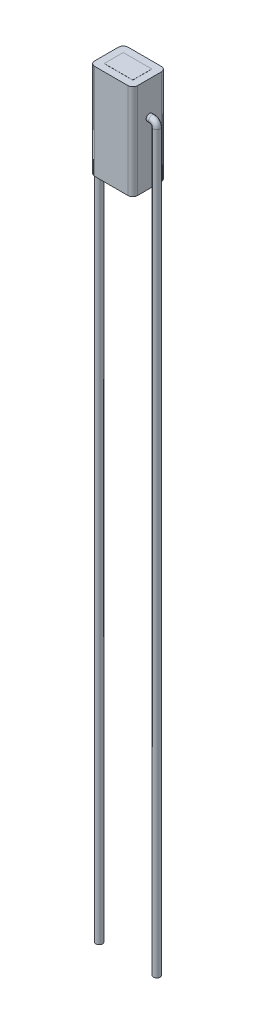
ISO-10303-21;
HEADER;
FILE_DESCRIPTION(('STEP AP214'),'2;1');
FILE_NAME('part.step','',(''),(''),'','','');
FILE_SCHEMA(('AUTOMOTIVE_DESIGN { 1 0 10303 214 1 1 1 1 }'));
ENDSEC;
DATA;
#1=APPLICATION_CONTEXT('core data for automotive mechanical design processes');
#2=APPLICATION_PROTOCOL_DEFINITION('international standard','automotive_design',2000,#1);
#3=PRODUCT_CONTEXT('',#1,'mechanical');
#4=PRODUCT('Part','Part','',(#3));
#5=PRODUCT_RELATED_PRODUCT_CATEGORY('part','',(#4));
#6=PRODUCT_DEFINITION_FORMATION('','',#4);
#7=PRODUCT_DEFINITION_CONTEXT('part definition',#1,'design');
#8=PRODUCT_DEFINITION('design','',#6,#7);
#9=PRODUCT_DEFINITION_SHAPE('','',#8);
#10=(LENGTH_UNIT() NAMED_UNIT(*) SI_UNIT(.MILLI.,.METRE.));
#11=(NAMED_UNIT(*) PLANE_ANGLE_UNIT() SI_UNIT($,.RADIAN.));
#12=(NAMED_UNIT(*) SI_UNIT($,.STERADIAN.) SOLID_ANGLE_UNIT());
#13=UNCERTAINTY_MEASURE_WITH_UNIT(LENGTH_MEASURE(1.E-05),#10,'distance_accuracy_value','');
#14=(GEOMETRIC_REPRESENTATION_CONTEXT(3) GLOBAL_UNCERTAINTY_ASSIGNED_CONTEXT((#13)) GLOBAL_UNIT_ASSIGNED_CONTEXT((#10,
#11,#12)) REPRESENTATION_CONTEXT('',''));
#15=CARTESIAN_POINT('',(0.,0.,0.));
#16=DIRECTION('',(0.,0.,1.));
#17=DIRECTION('',(1.,0.,0.));
#18=AXIS2_PLACEMENT_3D('',#15,#16,#17);
#19=CARTESIAN_POINT('',(2.25,10.,-1.75));
#20=DIRECTION('',(-1.,0.,0.));
#21=DIRECTION('',(0.,0.,1.));
#22=AXIS2_PLACEMENT_3D('',#19,#20,#21);
#23=PLANE('',#22);
#24=CARTESIAN_POINT('',(2.25,6.5,0.));
#25=DIRECTION('',(1.,0.,0.));
#26=DIRECTION('',(0.,0.,-1.));
#27=AXIS2_PLACEMENT_3D('',#24,#25,#26);
#28=CIRCLE('',#27,0.35);
#29=CARTESIAN_POINT('',(2.25,6.5,-0.35));
#30=VERTEX_POINT('',#29);
#31=EDGE_CURVE('E168',#30,#30,#28,.T.);
#32=ORIENTED_EDGE('',*,*,#31,.F.);
#33=EDGE_LOOP('',(#32));
#34=FACE_BOUND('',#33,.T.);
#35=DIRECTION('',(0.,0.,-1.));
#36=VECTOR('',#35,1.);
#37=CARTESIAN_POINT('',(2.25,10.,-1.75));
#38=LINE('',#37,#36);
#39=CARTESIAN_POINT('',(2.25,10.,1.25));
#40=VERTEX_POINT('',#39);
#41=CARTESIAN_POINT('',(2.25,10.,-1.25));
#42=VERTEX_POINT('',#41);
#43=EDGE_CURVE('E241',#40,#42,#38,.T.);
#44=ORIENTED_EDGE('',*,*,#43,.F.);
#45=DIRECTION('',(0.,-1.,0.));
#46=VECTOR('',#45,1.);
#47=CARTESIAN_POINT('',(2.25,10.,1.25));
#48=LINE('',#47,#46);
#49=CARTESIAN_POINT('',(2.25,0.,1.25));
#50=VERTEX_POINT('',#49);
#51=EDGE_CURVE('E275',#40,#50,#48,.T.);
#52=ORIENTED_EDGE('',*,*,#51,.T.);
#53=DIRECTION('',(0.,0.,-1.));
#54=VECTOR('',#53,1.);
#55=CARTESIAN_POINT('',(2.25,0.,-1.75));
#56=LINE('',#55,#54);
#57=CARTESIAN_POINT('',(2.25,0.,-1.25));
#58=VERTEX_POINT('',#57);
#59=EDGE_CURVE('E240',#50,#58,#56,.T.);
#60=ORIENTED_EDGE('',*,*,#59,.T.);
#61=DIRECTION('',(0.,-1.,0.));
#62=VECTOR('',#61,1.);
#63=CARTESIAN_POINT('',(2.25,10.,-1.25));
#64=LINE('',#63,#62);
#65=EDGE_CURVE('E273',#58,#42,#64,.F.);
#66=ORIENTED_EDGE('',*,*,#65,.T.);
#67=EDGE_LOOP('',(#44,#52,#60,#66));
#68=FACE_BOUND('',#67,.T.);
#69=ADVANCED_FACE('F46',(#34,#68),#23,.F.);
#70=CARTESIAN_POINT('',(-2.25,10.,-1.75));
#71=DIRECTION('',(0.,0.,1.));
#72=DIRECTION('',(1.,0.,0.));
#73=AXIS2_PLACEMENT_3D('',#70,#71,#72);
#74=PLANE('',#73);
#75=DIRECTION('',(-1.,0.,0.));
#76=VECTOR('',#75,1.);
#77=CARTESIAN_POINT('',(-2.25,0.,-1.75));
#78=LINE('',#77,#76);
#79=CARTESIAN_POINT('',(1.75,0.,-1.75));
#80=VERTEX_POINT('',#79);
#81=CARTESIAN_POINT('',(-1.75,0.,-1.75));
#82=VERTEX_POINT('',#81);
#83=EDGE_CURVE('E255',#80,#82,#78,.T.);
#84=ORIENTED_EDGE('',*,*,#83,.T.);
#85=DIRECTION('',(0.,-1.,0.));
#86=VECTOR('',#85,1.);
#87=CARTESIAN_POINT('',(-1.75,10.,-1.75));
#88=LINE('',#87,#86);
#89=CARTESIAN_POINT('',(-1.75,10.,-1.75));
#90=VERTEX_POINT('',#89);
#91=EDGE_CURVE('E13',#82,#90,#88,.F.);
#92=ORIENTED_EDGE('',*,*,#91,.T.);
#93=DIRECTION('',(-1.,0.,0.));
#94=VECTOR('',#93,1.);
#95=CARTESIAN_POINT('',(-2.25,10.,-1.75));
#96=LINE('',#95,#94);
#97=CARTESIAN_POINT('',(1.75,10.,-1.75));
#98=VERTEX_POINT('',#97);
#99=EDGE_CURVE('E244',#98,#90,#96,.T.);
#100=ORIENTED_EDGE('',*,*,#99,.F.);
#101=DIRECTION('',(0.,-1.,0.));
#102=VECTOR('',#101,1.);
#103=CARTESIAN_POINT('',(1.75,10.,-1.75));
#104=LINE('',#103,#102);
#105=EDGE_CURVE('E54',#98,#80,#104,.T.);
#106=ORIENTED_EDGE('',*,*,#105,.T.);
#107=EDGE_LOOP('',(#84,#92,#100,#106));
#108=FACE_BOUND('',#107,.T.);
#109=ADVANCED_FACE('F306',(#108),#74,.F.);
#110=CARTESIAN_POINT('',(-2.25,10.,-1.75));
#111=DIRECTION('',(1.,0.,0.));
#112=DIRECTION('',(0.,0.,-1.));
#113=AXIS2_PLACEMENT_3D('',#110,#111,#112);
#114=PLANE('',#113);
#115=CARTESIAN_POINT('',(-2.25,6.5,0.));
#116=DIRECTION('',(1.,0.,0.));
#117=DIRECTION('',(0.,0.,-1.));
#118=AXIS2_PLACEMENT_3D('',#115,#116,#117);
#119=CIRCLE('',#118,0.35);
#120=CARTESIAN_POINT('',(-2.25,6.5,-0.35));
#121=VERTEX_POINT('',#120);
#122=EDGE_CURVE('E662',#121,#121,#119,.F.);
#123=ORIENTED_EDGE('',*,*,#122,.F.);
#124=EDGE_LOOP('',(#123));
#125=FACE_BOUND('',#124,.T.);
#126=DIRECTION('',(0.,0.,1.));
#127=VECTOR('',#126,1.);
#128=CARTESIAN_POINT('',(-2.25,0.,-1.75));
#129=LINE('',#128,#127);
#130=CARTESIAN_POINT('',(-2.25,0.,-1.25));
#131=VERTEX_POINT('',#130);
#132=CARTESIAN_POINT('',(-2.25,0.,1.25));
#133=VERTEX_POINT('',#132);
#134=EDGE_CURVE('E258',#131,#133,#129,.T.);
#135=ORIENTED_EDGE('',*,*,#134,.T.);
#136=DIRECTION('',(0.,-1.,0.));
#137=VECTOR('',#136,1.);
#138=CARTESIAN_POINT('',(-2.25,10.,1.25));
#139=LINE('',#138,#137);
#140=CARTESIAN_POINT('',(-2.25,10.,1.25));
#141=VERTEX_POINT('',#140);
#142=EDGE_CURVE('E61',#133,#141,#139,.F.);
#143=ORIENTED_EDGE('',*,*,#142,.T.);
#144=DIRECTION('',(0.,0.,1.));
#145=VECTOR('',#144,1.);
#146=CARTESIAN_POINT('',(-2.25,10.,-1.75));
#147=LINE('',#146,#145);
#148=CARTESIAN_POINT('',(-2.25,10.,-1.25));
#149=VERTEX_POINT('',#148);
#150=EDGE_CURVE('E247',#149,#141,#147,.T.);
#151=ORIENTED_EDGE('',*,*,#150,.F.);
#152=DIRECTION('',(0.,-1.,0.));
#153=VECTOR('',#152,1.);
#154=CARTESIAN_POINT('',(-2.25,10.,-1.25));
#155=LINE('',#154,#153);
#156=EDGE_CURVE('E298',#149,#131,#155,.T.);
#157=ORIENTED_EDGE('',*,*,#156,.T.);
#158=EDGE_LOOP('',(#135,#143,#151,#157));
#159=FACE_BOUND('',#158,.T.);
#160=ADVANCED_FACE('F317',(#125,#159),#114,.F.);
#161=CARTESIAN_POINT('',(-2.25,10.,1.75));
#162=DIRECTION('',(0.,0.,-1.));
#163=DIRECTION('',(-1.,0.,0.));
#164=AXIS2_PLACEMENT_3D('',#161,#162,#163);
#165=PLANE('',#164);
#166=DIRECTION('',(1.,0.,0.));
#167=VECTOR('',#166,1.);
#168=CARTESIAN_POINT('',(-2.25,0.,1.75));
#169=LINE('',#168,#167);
#170=CARTESIAN_POINT('',(-1.75,0.,1.75));
#171=VERTEX_POINT('',#170);
#172=CARTESIAN_POINT('',(1.75,0.,1.75));
#173=VERTEX_POINT('',#172);
#174=EDGE_CURVE('E245',#171,#173,#169,.T.);
#175=ORIENTED_EDGE('',*,*,#174,.T.);
#176=DIRECTION('',(0.,-1.,0.));
#177=VECTOR('',#176,1.);
#178=CARTESIAN_POINT('',(1.75,10.,1.75));
#179=LINE('',#178,#177);
#180=CARTESIAN_POINT('',(1.75,10.,1.75));
#181=VERTEX_POINT('',#180);
#182=EDGE_CURVE('E289',#173,#181,#179,.F.);
#183=ORIENTED_EDGE('',*,*,#182,.T.);
#184=DIRECTION('',(1.,0.,0.));
#185=VECTOR('',#184,1.);
#186=CARTESIAN_POINT('',(-2.25,10.,1.75));
#187=LINE('',#186,#185);
#188=CARTESIAN_POINT('',(-1.75,10.,1.75));
#189=VERTEX_POINT('',#188);
#190=EDGE_CURVE('E249',#189,#181,#187,.T.);
#191=ORIENTED_EDGE('',*,*,#190,.F.);
#192=DIRECTION('',(0.,-1.,0.));
#193=VECTOR('',#192,1.);
#194=CARTESIAN_POINT('',(-1.75,10.,1.75));
#195=LINE('',#194,#193);
#196=EDGE_CURVE('E286',#189,#171,#195,.T.);
#197=ORIENTED_EDGE('',*,*,#196,.T.);
#198=EDGE_LOOP('',(#175,#183,#191,#197));
#199=FACE_BOUND('',#198,.T.);
#200=ADVANCED_FACE('F326',(#199),#165,.F.);
#201=CARTESIAN_POINT('',(0.,10.,0.));
#202=DIRECTION('',(0.,1.,0.));
#203=DIRECTION('',(0.,0.,1.));
#204=AXIS2_PLACEMENT_3D('',#201,#202,#203);
#205=PLANE('',#204);
#206=DIRECTION('',(0.,0.,-1.));
#207=VECTOR('',#206,1.);
#208=CARTESIAN_POINT('',(1.5,10.,0.));
#209=LINE('',#208,#207);
#210=CARTESIAN_POINT('',(1.5,10.,1.));
#211=VERTEX_POINT('',#210);
#212=CARTESIAN_POINT('',(1.5,10.,-1.));
#213=VERTEX_POINT('',#212);
#214=EDGE_CURVE('E237',#211,#213,#209,.T.);
#215=ORIENTED_EDGE('',*,*,#214,.F.);
#216=DIRECTION('',(1.,0.,0.));
#217=VECTOR('',#216,1.);
#218=CARTESIAN_POINT('',(0.,10.,1.));
#219=LINE('',#218,#217);
#220=CARTESIAN_POINT('',(-1.5,10.,1.));
#221=VERTEX_POINT('',#220);
#222=EDGE_CURVE('E234',#221,#211,#219,.T.);
#223=ORIENTED_EDGE('',*,*,#222,.F.);
#224=DIRECTION('',(0.,0.,1.));
#225=VECTOR('',#224,1.);
#226=CARTESIAN_POINT('',(-1.5,10.,0.));
#227=LINE('',#226,#225);
#228=CARTESIAN_POINT('',(-1.5,10.,-1.));
#229=VERTEX_POINT('',#228);
#230=EDGE_CURVE('E231',#229,#221,#227,.T.);
#231=ORIENTED_EDGE('',*,*,#230,.F.);
#232=DIRECTION('',(-1.,0.,0.));
#233=VECTOR('',#232,1.);
#234=CARTESIAN_POINT('',(0.,10.,-1.));
#235=LINE('',#234,#233);
#236=EDGE_CURVE('E217',#213,#229,#235,.T.);
#237=ORIENTED_EDGE('',*,*,#236,.F.);
#238=EDGE_LOOP('',(#215,#223,#231,#237));
#239=FACE_BOUND('',#238,.T.);
#240=ORIENTED_EDGE('',*,*,#190,.T.);
#241=CARTESIAN_POINT('',(1.75,10.,1.25));
#242=DIRECTION('',(0.,1.,0.));
#243=DIRECTION('',(0.,0.,1.));
#244=AXIS2_PLACEMENT_3D('',#241,#242,#243);
#245=CIRCLE('',#244,0.5);
#246=EDGE_CURVE('E296',#181,#40,#245,.T.);
#247=ORIENTED_EDGE('',*,*,#246,.T.);
#248=ORIENTED_EDGE('',*,*,#43,.T.);
#249=CARTESIAN_POINT('',(1.75,10.,-1.25));
#250=DIRECTION('',(0.,1.,0.));
#251=DIRECTION('',(0.,0.,1.));
#252=AXIS2_PLACEMENT_3D('',#249,#250,#251);
#253=CIRCLE('',#252,0.5);
#254=EDGE_CURVE('E291',#42,#98,#253,.T.);
#255=ORIENTED_EDGE('',*,*,#254,.T.);
#256=ORIENTED_EDGE('',*,*,#99,.T.);
#257=CARTESIAN_POINT('',(-1.75,10.,-1.25));
#258=DIRECTION('',(0.,1.,0.));
#259=DIRECTION('',(0.,0.,1.));
#260=AXIS2_PLACEMENT_3D('',#257,#258,#259);
#261=CIRCLE('',#260,0.5);
#262=EDGE_CURVE('E68',#90,#149,#261,.T.);
#263=ORIENTED_EDGE('',*,*,#262,.T.);
#264=ORIENTED_EDGE('',*,*,#150,.T.);
#265=CARTESIAN_POINT('',(-1.75,10.,1.25));
#266=DIRECTION('',(0.,1.,0.));
#267=DIRECTION('',(0.,0.,1.));
#268=AXIS2_PLACEMENT_3D('',#265,#266,#267);
#269=CIRCLE('',#268,0.5);
#270=EDGE_CURVE('E294',#141,#189,#269,.T.);
#271=ORIENTED_EDGE('',*,*,#270,.T.);
#272=EDGE_LOOP('',(#240,#247,#248,#255,#256,#263,#264,#271));
#273=FACE_BOUND('',#272,.T.);
#274=ADVANCED_FACE('F319',(#239,#273),#205,.T.);
#275=CARTESIAN_POINT('',(0.,0.,0.));
#276=DIRECTION('',(0.,1.,0.));
#277=DIRECTION('',(0.,0.,1.));
#278=AXIS2_PLACEMENT_3D('',#275,#276,#277);
#279=PLANE('',#278);
#280=DIRECTION('',(1.,0.,0.));
#281=VECTOR('',#280,1.);
#282=CARTESIAN_POINT('',(0.,0.,1.));
#283=LINE('',#282,#281);
#284=CARTESIAN_POINT('',(-1.5,0.,1.));
#285=VERTEX_POINT('',#284);
#286=CARTESIAN_POINT('',(1.5,0.,1.));
#287=VERTEX_POINT('',#286);
#288=EDGE_CURVE('E267',#285,#287,#283,.T.);
#289=ORIENTED_EDGE('',*,*,#288,.T.);
#290=DIRECTION('',(0.,0.,-1.));
#291=VECTOR('',#290,1.);
#292=CARTESIAN_POINT('',(1.5,0.,0.));
#293=LINE('',#292,#291);
#294=CARTESIAN_POINT('',(1.5,0.,-1.));
#295=VERTEX_POINT('',#294);
#296=EDGE_CURVE('E270',#287,#295,#293,.T.);
#297=ORIENTED_EDGE('',*,*,#296,.T.);
#298=DIRECTION('',(-1.,0.,0.));
#299=VECTOR('',#298,1.);
#300=CARTESIAN_POINT('',(0.,0.,-1.));
#301=LINE('',#300,#299);
#302=CARTESIAN_POINT('',(-1.5,0.,-1.));
#303=VERTEX_POINT('',#302);
#304=EDGE_CURVE('E252',#295,#303,#301,.T.);
#305=ORIENTED_EDGE('',*,*,#304,.T.);
#306=DIRECTION('',(0.,0.,1.));
#307=VECTOR('',#306,1.);
#308=CARTESIAN_POINT('',(-1.5,0.,0.));
#309=LINE('',#308,#307);
#310=EDGE_CURVE('E264',#303,#285,#309,.T.);
#311=ORIENTED_EDGE('',*,*,#310,.T.);
#312=EDGE_LOOP('',(#289,#297,#305,#311));
#313=FACE_BOUND('',#312,.T.);
#314=ORIENTED_EDGE('',*,*,#59,.F.);
#315=CARTESIAN_POINT('',(1.75,0.,1.25));
#316=DIRECTION('',(0.,1.,0.));
#317=DIRECTION('',(0.,0.,1.));
#318=AXIS2_PLACEMENT_3D('',#315,#316,#317);
#319=CIRCLE('',#318,0.5);
#320=EDGE_CURVE('E284',#50,#173,#319,.F.);
#321=ORIENTED_EDGE('',*,*,#320,.T.);
#322=ORIENTED_EDGE('',*,*,#174,.F.);
#323=CARTESIAN_POINT('',(-1.75,0.,1.25));
#324=DIRECTION('',(0.,1.,0.));
#325=DIRECTION('',(0.,0.,1.));
#326=AXIS2_PLACEMENT_3D('',#323,#324,#325);
#327=CIRCLE('',#326,0.5);
#328=EDGE_CURVE('E282',#171,#133,#327,.F.);
#329=ORIENTED_EDGE('',*,*,#328,.T.);
#330=ORIENTED_EDGE('',*,*,#134,.F.);
#331=CARTESIAN_POINT('',(-1.75,0.,-1.25));
#332=DIRECTION('',(0.,1.,0.));
#333=DIRECTION('',(0.,0.,1.));
#334=AXIS2_PLACEMENT_3D('',#331,#332,#333);
#335=CIRCLE('',#334,0.5);
#336=EDGE_CURVE('E280',#131,#82,#335,.F.);
#337=ORIENTED_EDGE('',*,*,#336,.T.);
#338=ORIENTED_EDGE('',*,*,#83,.F.);
#339=CARTESIAN_POINT('',(1.75,0.,-1.25));
#340=DIRECTION('',(0.,1.,0.));
#341=DIRECTION('',(0.,0.,1.));
#342=AXIS2_PLACEMENT_3D('',#339,#340,#341);
#343=CIRCLE('',#342,0.5);
#344=EDGE_CURVE('E278',#80,#58,#343,.F.);
#345=ORIENTED_EDGE('',*,*,#344,.T.);
#346=EDGE_LOOP('',(#314,#321,#322,#329,#330,#337,#338,#345));
#347=FACE_BOUND('',#346,.T.);
#348=ADVANCED_FACE('F312',(#313,#347),#279,.F.);
#349=CARTESIAN_POINT('',(0.,-0.01,0.));
#350=DIRECTION('',(0.,1.,0.));
#351=DIRECTION('',(0.,0.,1.));
#352=AXIS2_PLACEMENT_3D('',#349,#350,#351);
#353=PLANE('',#352);
#354=DIRECTION('',(0.,0.,-1.));
#355=VECTOR('',#354,1.);
#356=CARTESIAN_POINT('',(1.5,-0.01,-1.));
#357=LINE('',#356,#355);
#358=CARTESIAN_POINT('',(1.5,-0.01,1.));
#359=VERTEX_POINT('',#358);
#360=CARTESIAN_POINT('',(1.5,-0.01,-1.));
#361=VERTEX_POINT('',#360);
#362=EDGE_CURVE('E201',#359,#361,#357,.T.);
#363=ORIENTED_EDGE('',*,*,#362,.F.);
#364=DIRECTION('',(1.,0.,0.));
#365=VECTOR('',#364,1.);
#366=CARTESIAN_POINT('',(-1.5,-0.01,1.));
#367=LINE('',#366,#365);
#368=CARTESIAN_POINT('',(-1.5,-0.01,1.));
#369=VERTEX_POINT('',#368);
#370=EDGE_CURVE('E210',#369,#359,#367,.T.);
#371=ORIENTED_EDGE('',*,*,#370,.F.);
#372=DIRECTION('',(0.,0.,1.));
#373=VECTOR('',#372,1.);
#374=CARTESIAN_POINT('',(-1.5,-0.01,-1.));
#375=LINE('',#374,#373);
#376=CARTESIAN_POINT('',(-1.5,-0.01,-1.));
#377=VERTEX_POINT('',#376);
#378=EDGE_CURVE('E207',#377,#369,#375,.T.);
#379=ORIENTED_EDGE('',*,*,#378,.F.);
#380=DIRECTION('',(-1.,0.,0.));
#381=VECTOR('',#380,1.);
#382=CARTESIAN_POINT('',(-1.5,-0.01,-1.));
#383=LINE('',#382,#381);
#384=EDGE_CURVE('E204',#361,#377,#383,.T.);
#385=ORIENTED_EDGE('',*,*,#384,.F.);
#386=EDGE_LOOP('',(#363,#371,#379,#385));
#387=FACE_BOUND('',#386,.T.);
#388=ADVANCED_FACE('F515',(#387),#353,.F.);
#389=CARTESIAN_POINT('',(-1.5,-0.01,-1.));
#390=DIRECTION('',(0.,0.,-1.));
#391=DIRECTION('',(-1.,0.,0.));
#392=AXIS2_PLACEMENT_3D('',#389,#390,#391);
#393=PLANE('',#392);
#394=ORIENTED_EDGE('',*,*,#304,.F.);
#395=DIRECTION('',(0.,1.,0.));
#396=VECTOR('',#395,1.);
#397=CARTESIAN_POINT('',(1.5,-0.01,-1.));
#398=LINE('',#397,#396);
#399=EDGE_CURVE('E226',#361,#295,#398,.T.);
#400=ORIENTED_EDGE('',*,*,#399,.F.);
#401=ORIENTED_EDGE('',*,*,#384,.T.);
#402=DIRECTION('',(0.,1.,0.));
#403=VECTOR('',#402,1.);
#404=CARTESIAN_POINT('',(-1.5,-0.01,-1.));
#405=LINE('',#404,#403);
#406=EDGE_CURVE('E223',#377,#303,#405,.T.);
#407=ORIENTED_EDGE('',*,*,#406,.T.);
#408=EDGE_LOOP('',(#394,#400,#401,#407));
#409=FACE_BOUND('',#408,.T.);
#410=ADVANCED_FACE('F518',(#409),#393,.T.);
#411=CARTESIAN_POINT('',(-1.5,-0.01,-1.));
#412=DIRECTION('',(-1.,0.,0.));
#413=DIRECTION('',(0.,0.,1.));
#414=AXIS2_PLACEMENT_3D('',#411,#412,#413);
#415=PLANE('',#414);
#416=ORIENTED_EDGE('',*,*,#310,.F.);
#417=ORIENTED_EDGE('',*,*,#406,.F.);
#418=ORIENTED_EDGE('',*,*,#378,.T.);
#419=DIRECTION('',(0.,1.,0.));
#420=VECTOR('',#419,1.);
#421=CARTESIAN_POINT('',(-1.5,-0.01,1.));
#422=LINE('',#421,#420);
#423=EDGE_CURVE('E219',#369,#285,#422,.T.);
#424=ORIENTED_EDGE('',*,*,#423,.T.);
#425=EDGE_LOOP('',(#416,#417,#418,#424));
#426=FACE_BOUND('',#425,.T.);
#427=ADVANCED_FACE('F530',(#426),#415,.T.);
#428=CARTESIAN_POINT('',(-1.5,-0.01,1.));
#429=DIRECTION('',(0.,0.,1.));
#430=DIRECTION('',(1.,0.,0.));
#431=AXIS2_PLACEMENT_3D('',#428,#429,#430);
#432=PLANE('',#431);
#433=ORIENTED_EDGE('',*,*,#288,.F.);
#434=ORIENTED_EDGE('',*,*,#423,.F.);
#435=ORIENTED_EDGE('',*,*,#370,.T.);
#436=DIRECTION('',(0.,1.,0.));
#437=VECTOR('',#436,1.);
#438=CARTESIAN_POINT('',(1.5,-0.01,1.));
#439=LINE('',#438,#437);
#440=EDGE_CURVE('E214',#359,#287,#439,.T.);
#441=ORIENTED_EDGE('',*,*,#440,.T.);
#442=EDGE_LOOP('',(#433,#434,#435,#441));
#443=FACE_BOUND('',#442,.T.);
#444=ADVANCED_FACE('F526',(#443),#432,.T.);
#445=CARTESIAN_POINT('',(1.5,-0.01,-1.));
#446=DIRECTION('',(1.,0.,0.));
#447=DIRECTION('',(0.,0.,-1.));
#448=AXIS2_PLACEMENT_3D('',#445,#446,#447);
#449=PLANE('',#448);
#450=ORIENTED_EDGE('',*,*,#296,.F.);
#451=ORIENTED_EDGE('',*,*,#440,.F.);
#452=ORIENTED_EDGE('',*,*,#362,.T.);
#453=ORIENTED_EDGE('',*,*,#399,.T.);
#454=EDGE_LOOP('',(#450,#451,#452,#453));
#455=FACE_BOUND('',#454,.T.);
#456=ADVANCED_FACE('F536',(#455),#449,.T.);
#457=CARTESIAN_POINT('',(1.5,10.01,1.));
#458=VERTEX_POINT('',#457);
#459=EDGE_CURVE('E218',#211,#458,#439,.T.);
#460=ORIENTED_EDGE('',*,*,#459,.F.);
#461=ORIENTED_EDGE('',*,*,#214,.T.);
#462=CARTESIAN_POINT('',(1.5,10.01,-1.));
#463=VERTEX_POINT('',#462);
#464=EDGE_CURVE('E213',#213,#463,#398,.T.);
#465=ORIENTED_EDGE('',*,*,#464,.T.);
#466=DIRECTION('',(0.,0.,-1.));
#467=VECTOR('',#466,1.);
#468=CARTESIAN_POINT('',(1.5,10.01,-1.));
#469=LINE('',#468,#467);
#470=EDGE_CURVE('E189',#458,#463,#469,.T.);
#471=ORIENTED_EDGE('',*,*,#470,.F.);
#472=EDGE_LOOP('',(#460,#461,#465,#471));
#473=FACE_BOUND('',#472,.T.);
#474=ADVANCED_FACE('F524',(#473),#449,.T.);
#475=CARTESIAN_POINT('',(-1.5,10.01,1.));
#476=VERTEX_POINT('',#475);
#477=EDGE_CURVE('E222',#221,#476,#422,.T.);
#478=ORIENTED_EDGE('',*,*,#477,.F.);
#479=ORIENTED_EDGE('',*,*,#222,.T.);
#480=ORIENTED_EDGE('',*,*,#459,.T.);
#481=DIRECTION('',(1.,0.,0.));
#482=VECTOR('',#481,1.);
#483=CARTESIAN_POINT('',(-1.5,10.01,1.));
#484=LINE('',#483,#482);
#485=EDGE_CURVE('E198',#476,#458,#484,.T.);
#486=ORIENTED_EDGE('',*,*,#485,.F.);
#487=EDGE_LOOP('',(#478,#479,#480,#486));
#488=FACE_BOUND('',#487,.T.);
#489=ADVANCED_FACE('F520',(#488),#432,.T.);
#490=CARTESIAN_POINT('',(-1.5,10.01,-1.));
#491=VERTEX_POINT('',#490);
#492=EDGE_CURVE('E225',#229,#491,#405,.T.);
#493=ORIENTED_EDGE('',*,*,#492,.F.);
#494=ORIENTED_EDGE('',*,*,#230,.T.);
#495=ORIENTED_EDGE('',*,*,#477,.T.);
#496=DIRECTION('',(0.,0.,1.));
#497=VECTOR('',#496,1.);
#498=CARTESIAN_POINT('',(-1.5,10.01,-1.));
#499=LINE('',#498,#497);
#500=EDGE_CURVE('E195',#491,#476,#499,.T.);
#501=ORIENTED_EDGE('',*,*,#500,.F.);
#502=EDGE_LOOP('',(#493,#494,#495,#501));
#503=FACE_BOUND('',#502,.T.);
#504=ADVANCED_FACE('F523',(#503),#415,.T.);
#505=ORIENTED_EDGE('',*,*,#464,.F.);
#506=ORIENTED_EDGE('',*,*,#236,.T.);
#507=ORIENTED_EDGE('',*,*,#492,.T.);
#508=DIRECTION('',(-1.,0.,0.));
#509=VECTOR('',#508,1.);
#510=CARTESIAN_POINT('',(-1.5,10.01,-1.));
#511=LINE('',#510,#509);
#512=EDGE_CURVE('E192',#463,#491,#511,.T.);
#513=ORIENTED_EDGE('',*,*,#512,.F.);
#514=EDGE_LOOP('',(#505,#506,#507,#513));
#515=FACE_BOUND('',#514,.T.);
#516=ADVANCED_FACE('F513',(#515),#393,.T.);
#517=CARTESIAN_POINT('',(0.,10.01,0.));
#518=DIRECTION('',(0.,1.,0.));
#519=DIRECTION('',(0.,0.,1.));
#520=AXIS2_PLACEMENT_3D('',#517,#518,#519);
#521=PLANE('',#520);
#522=ORIENTED_EDGE('',*,*,#470,.T.);
#523=ORIENTED_EDGE('',*,*,#512,.T.);
#524=ORIENTED_EDGE('',*,*,#500,.T.);
#525=ORIENTED_EDGE('',*,*,#485,.T.);
#526=EDGE_LOOP('',(#522,#523,#524,#525));
#527=FACE_BOUND('',#526,.T.);
#528=ADVANCED_FACE('F362',(#527),#521,.T.);
#529=CARTESIAN_POINT('',(1.75,10.,1.25));
#530=DIRECTION('',(0.,-1.,0.));
#531=DIRECTION('',(0.,0.,-1.));
#532=AXIS2_PLACEMENT_3D('',#529,#530,#531);
#533=CYLINDRICAL_SURFACE('',#532,0.5);
#534=ORIENTED_EDGE('',*,*,#246,.F.);
#535=ORIENTED_EDGE('',*,*,#182,.F.);
#536=ORIENTED_EDGE('',*,*,#320,.F.);
#537=ORIENTED_EDGE('',*,*,#51,.F.);
#538=EDGE_LOOP('',(#534,#535,#536,#537));
#539=FACE_BOUND('',#538,.T.);
#540=ADVANCED_FACE('F331',(#539),#533,.T.);
#541=CARTESIAN_POINT('',(-1.75,10.,1.25));
#542=DIRECTION('',(0.,-1.,0.));
#543=DIRECTION('',(0.,0.,-1.));
#544=AXIS2_PLACEMENT_3D('',#541,#542,#543);
#545=CYLINDRICAL_SURFACE('',#544,0.5);
#546=ORIENTED_EDGE('',*,*,#270,.F.);
#547=ORIENTED_EDGE('',*,*,#142,.F.);
#548=ORIENTED_EDGE('',*,*,#328,.F.);
#549=ORIENTED_EDGE('',*,*,#196,.F.);
#550=EDGE_LOOP('',(#546,#547,#548,#549));
#551=FACE_BOUND('',#550,.T.);
#552=ADVANCED_FACE('F323',(#551),#545,.T.);
#553=CARTESIAN_POINT('',(-1.75,10.,-1.25));
#554=DIRECTION('',(0.,-1.,0.));
#555=DIRECTION('',(0.,0.,-1.));
#556=AXIS2_PLACEMENT_3D('',#553,#554,#555);
#557=CYLINDRICAL_SURFACE('',#556,0.5);
#558=ORIENTED_EDGE('',*,*,#262,.F.);
#559=ORIENTED_EDGE('',*,*,#91,.F.);
#560=ORIENTED_EDGE('',*,*,#336,.F.);
#561=ORIENTED_EDGE('',*,*,#156,.F.);
#562=EDGE_LOOP('',(#558,#559,#560,#561));
#563=FACE_BOUND('',#562,.T.);
#564=ADVANCED_FACE('F316',(#563),#557,.T.);
#565=CARTESIAN_POINT('',(1.75,10.,-1.25));
#566=DIRECTION('',(0.,-1.,0.));
#567=DIRECTION('',(0.,0.,-1.));
#568=AXIS2_PLACEMENT_3D('',#565,#566,#567);
#569=CYLINDRICAL_SURFACE('',#568,0.5);
#570=ORIENTED_EDGE('',*,*,#254,.F.);
#571=ORIENTED_EDGE('',*,*,#65,.F.);
#572=ORIENTED_EDGE('',*,*,#344,.F.);
#573=ORIENTED_EDGE('',*,*,#105,.F.);
#574=EDGE_LOOP('',(#570,#571,#572,#573));
#575=FACE_BOUND('',#574,.T.);
#576=ADVANCED_FACE('F48',(#575),#569,.T.);
#577=CARTESIAN_POINT('',(3.02591837528372,-71.1462179217916,0.));
#578=DIRECTION('',(0.,-1.,0.));
#579=DIRECTION('',(0.,0.,-1.));
#580=AXIS2_PLACEMENT_3D('',#577,#578,#579);
#581=PLANE('',#580);
#582=CARTESIAN_POINT('',(3.02591837528372,-71.1462179217916,0.));
#583=DIRECTION('',(0.,-1.,0.));
#584=DIRECTION('',(0.,0.,-1.));
#585=AXIS2_PLACEMENT_3D('',#582,#583,#584);
#586=CIRCLE('',#585,0.35);
#587=CARTESIAN_POINT('',(3.02591837528372,-71.1462179217916,-0.35));
#588=VERTEX_POINT('',#587);
#589=EDGE_CURVE('E187',#588,#588,#586,.T.);
#590=ORIENTED_EDGE('',*,*,#589,.T.);
#591=EDGE_LOOP('',(#590));
#592=FACE_BOUND('',#591,.T.);
#593=ADVANCED_FACE('F336',(#592),#581,.T.);
#594=CARTESIAN_POINT('',(2.25,6.5,0.));
#595=DIRECTION('',(1.,0.,0.));
#596=DIRECTION('',(0.,0.,-1.));
#597=AXIS2_PLACEMENT_3D('',#594,#595,#596);
#598=CYLINDRICAL_SURFACE('',#597,0.35);
#599=CARTESIAN_POINT('',(2.3,6.5,0.));
#600=DIRECTION('',(1.,0.,0.));
#601=DIRECTION('',(0.,0.,-1.));
#602=AXIS2_PLACEMENT_3D('',#599,#600,#601);
#603=CIRCLE('',#602,0.35);
#604=CARTESIAN_POINT('',(2.3,6.5,-0.35));
#605=VERTEX_POINT('',#604);
#606=EDGE_CURVE('E172',#605,#605,#603,.T.);
#607=ORIENTED_EDGE('',*,*,#606,.F.);
#608=EDGE_LOOP('',(#607));
#609=FACE_BOUND('',#608,.T.);
#610=ORIENTED_EDGE('',*,*,#31,.T.);
#611=EDGE_LOOP('',(#610));
#612=FACE_BOUND('',#611,.T.);
#613=ADVANCED_FACE('F342',(#609,#612),#598,.T.);
#614=CARTESIAN_POINT('',(2.3,6.5,0.));
#615=DIRECTION('',(1.,0.,0.));
#616=DIRECTION('',(0.,0.,-1.));
#617=AXIS2_PLACEMENT_3D('',#614,#615,#616);
#618=CYLINDRICAL_SURFACE('',#617,0.35);
#619=CARTESIAN_POINT('',(2.52591837528371,6.5,0.));
#620=DIRECTION('',(1.,0.,0.));
#621=DIRECTION('',(0.,0.,-1.));
#622=AXIS2_PLACEMENT_3D('',#619,#620,#621);
#623=CIRCLE('',#622,0.35);
#624=CARTESIAN_POINT('',(2.52591837528371,6.85,0.));
#625=VERTEX_POINT('',#624);
#626=EDGE_CURVE('E181',#625,#625,#623,.T.);
#627=ORIENTED_EDGE('',*,*,#626,.F.);
#628=EDGE_LOOP('',(#627));
#629=FACE_BOUND('',#628,.T.);
#630=ORIENTED_EDGE('',*,*,#606,.T.);
#631=EDGE_LOOP('',(#630));
#632=FACE_BOUND('',#631,.T.);
#633=ADVANCED_FACE('F398',(#629,#632),#618,.T.);
#634=CARTESIAN_POINT('',(2.52591837528371,6.,0.));
#635=DIRECTION('',(0.,0.,-1.));
#636=DIRECTION('',(-1.,0.,0.));
#637=AXIS2_PLACEMENT_3D('',#634,#635,#636);
#638=TOROIDAL_SURFACE('',#637,0.5,0.35);
#639=CARTESIAN_POINT('',(3.02591837528371,6.,0.));
#640=DIRECTION('',(0.,-1.,0.));
#641=DIRECTION('',(0.,0.,-1.));
#642=AXIS2_PLACEMENT_3D('',#639,#640,#641);
#643=CIRCLE('',#642,0.35);
#644=CARTESIAN_POINT('',(3.37591837528371,6.,0.));
#645=VERTEX_POINT('',#644);
#646=EDGE_CURVE('E184',#645,#645,#643,.T.);
#647=CARTESIAN_POINT('',(2.52591837528371,6.,0.));
#648=DIRECTION('',(0.,0.,-1.));
#649=DIRECTION('',(-1.,0.,0.));
#650=AXIS2_PLACEMENT_3D('',#647,#648,#649);
#651=CIRCLE('',#650,0.849999999999999);
#652=EDGE_CURVE('',#625,#645,#651,.T.);
#653=ORIENTED_EDGE('',*,*,#626,.T.);
#654=ORIENTED_EDGE('',*,*,#646,.F.);
#655=ORIENTED_EDGE('',*,*,#652,.T.);
#656=ORIENTED_EDGE('',*,*,#652,.F.);
#657=EDGE_LOOP('',(#653,#655,#654,#656));
#658=FACE_BOUND('',#657,.T.);
#659=ADVANCED_FACE('F347',(#658),#638,.T.);
#660=CARTESIAN_POINT('',(3.02591837528371,6.,0.));
#661=DIRECTION('',(0.,-1.,0.));
#662=DIRECTION('',(1.,0.,0.));
#663=AXIS2_PLACEMENT_3D('',#660,#661,#662);
#664=CYLINDRICAL_SURFACE('',#663,0.35);
#665=ORIENTED_EDGE('',*,*,#589,.F.);
#666=EDGE_LOOP('',(#665));
#667=FACE_BOUND('',#666,.T.);
#668=ORIENTED_EDGE('',*,*,#646,.T.);
#669=EDGE_LOOP('',(#668));
#670=FACE_BOUND('',#669,.T.);
#671=ADVANCED_FACE('F337',(#667,#670),#664,.T.);
#672=CARTESIAN_POINT('',(-3.02591837528372,-71.1462179217916,0.));
#673=DIRECTION('',(0.,-1.,0.));
#674=DIRECTION('',(0.,0.,-1.));
#675=AXIS2_PLACEMENT_3D('',#672,#673,#674);
#676=PLANE('',#675);
#677=CARTESIAN_POINT('',(-3.02591837528372,-71.1462179217916,0.));
#678=DIRECTION('',(0.,1.,0.));
#679=DIRECTION('',(0.,0.,-1.));
#680=AXIS2_PLACEMENT_3D('',#677,#678,#679);
#681=CIRCLE('',#680,0.35);
#682=CARTESIAN_POINT('',(-3.02591837528372,-71.1462179217916,-0.35));
#683=VERTEX_POINT('',#682);
#684=EDGE_CURVE('E165',#683,#683,#681,.F.);
#685=ORIENTED_EDGE('',*,*,#684,.T.);
#686=EDGE_LOOP('',(#685));
#687=FACE_BOUND('',#686,.T.);
#688=ADVANCED_FACE('F166',(#687),#676,.T.);
#689=CARTESIAN_POINT('',(-2.25,6.5,0.));
#690=DIRECTION('',(-1.,0.,0.));
#691=DIRECTION('',(0.,0.,1.));
#692=AXIS2_PLACEMENT_3D('',#689,#690,#691);
#693=CYLINDRICAL_SURFACE('',#692,0.35);
#694=CARTESIAN_POINT('',(-2.3,6.5,0.));
#695=DIRECTION('',(1.,0.,0.));
#696=DIRECTION('',(0.,0.,-1.));
#697=AXIS2_PLACEMENT_3D('',#694,#695,#696);
#698=CIRCLE('',#697,0.35);
#699=CARTESIAN_POINT('',(-2.3,6.5,-0.35));
#700=VERTEX_POINT('',#699);
#701=EDGE_CURVE('E660',#700,#700,#698,.F.);
#702=ORIENTED_EDGE('',*,*,#701,.F.);
#703=EDGE_LOOP('',(#702));
#704=FACE_BOUND('',#703,.T.);
#705=ORIENTED_EDGE('',*,*,#122,.T.);
#706=EDGE_LOOP('',(#705));
#707=FACE_BOUND('',#706,.T.);
#708=ADVANCED_FACE('F448',(#704,#707),#693,.T.);
#709=CARTESIAN_POINT('',(-2.3,6.5,0.));
#710=DIRECTION('',(-1.,0.,0.));
#711=DIRECTION('',(0.,0.,1.));
#712=AXIS2_PLACEMENT_3D('',#709,#710,#711);
#713=CYLINDRICAL_SURFACE('',#712,0.35);
#714=CARTESIAN_POINT('',(-2.52591837528371,6.5,0.));
#715=DIRECTION('',(1.,0.,0.));
#716=DIRECTION('',(0.,0.,-1.));
#717=AXIS2_PLACEMENT_3D('',#714,#715,#716);
#718=CIRCLE('',#717,0.35);
#719=CARTESIAN_POINT('',(-2.52591837528371,6.85,0.));
#720=VERTEX_POINT('',#719);
#721=EDGE_CURVE('E175',#720,#720,#718,.F.);
#722=ORIENTED_EDGE('',*,*,#721,.F.);
#723=EDGE_LOOP('',(#722));
#724=FACE_BOUND('',#723,.T.);
#725=ORIENTED_EDGE('',*,*,#701,.T.);
#726=EDGE_LOOP('',(#725));
#727=FACE_BOUND('',#726,.T.);
#728=ADVANCED_FACE('F458',(#724,#727),#713,.T.);
#729=CARTESIAN_POINT('',(-2.52591837528371,6.,0.));
#730=DIRECTION('',(0.,0.,1.));
#731=DIRECTION('',(1.,0.,0.));
#732=AXIS2_PLACEMENT_3D('',#729,#730,#731);
#733=TOROIDAL_SURFACE('',#732,0.5,0.35);
#734=CARTESIAN_POINT('',(-3.02591837528371,6.,0.));
#735=DIRECTION('',(0.,1.,0.));
#736=DIRECTION('',(0.,0.,-1.));
#737=AXIS2_PLACEMENT_3D('',#734,#735,#736);
#738=CIRCLE('',#737,0.35);
#739=CARTESIAN_POINT('',(-3.37591837528371,6.,0.));
#740=VERTEX_POINT('',#739);
#741=EDGE_CURVE('E169',#740,#740,#738,.F.);
#742=CARTESIAN_POINT('',(-2.52591837528371,6.,0.));
#743=DIRECTION('',(0.,0.,1.));
#744=DIRECTION('',(1.,0.,0.));
#745=AXIS2_PLACEMENT_3D('',#742,#743,#744);
#746=CIRCLE('',#745,0.849999999999999);
#747=EDGE_CURVE('',#720,#740,#746,.T.);
#748=ORIENTED_EDGE('',*,*,#721,.T.);
#749=ORIENTED_EDGE('',*,*,#741,.F.);
#750=ORIENTED_EDGE('',*,*,#747,.T.);
#751=ORIENTED_EDGE('',*,*,#747,.F.);
#752=EDGE_LOOP('',(#748,#750,#749,#751));
#753=FACE_BOUND('',#752,.T.);
#754=ADVANCED_FACE('F469',(#753),#733,.T.);
#755=CARTESIAN_POINT('',(-3.02591837528371,6.,0.));
#756=DIRECTION('',(0.,-1.,0.));
#757=DIRECTION('',(1.,0.,0.));
#758=AXIS2_PLACEMENT_3D('',#755,#756,#757);
#759=CYLINDRICAL_SURFACE('',#758,0.35);
#760=ORIENTED_EDGE('',*,*,#684,.F.);
#761=EDGE_LOOP('',(#760));
#762=FACE_BOUND('',#761,.T.);
#763=ORIENTED_EDGE('',*,*,#741,.T.);
#764=EDGE_LOOP('',(#763));
#765=FACE_BOUND('',#764,.T.);
#766=ADVANCED_FACE('F345',(#762,#765),#759,.T.);
#767=CLOSED_SHELL('',(#69,#109,#160,#200,#274,#348,#388,#410,#427,#444,#456,#474,#489,#504,#516,
#528,#540,#552,#564,#576,#593,#613,#633,#659,#671,#688,#708,#728,#754,#766));
#768=MANIFOLD_SOLID_BREP('B2',#767);
#769=ADVANCED_BREP_SHAPE_REPRESENTATION('',(#18,#768),#14);
#770=SHAPE_DEFINITION_REPRESENTATION(#9,#769);
ENDSEC;
END-ISO-10303-21;
